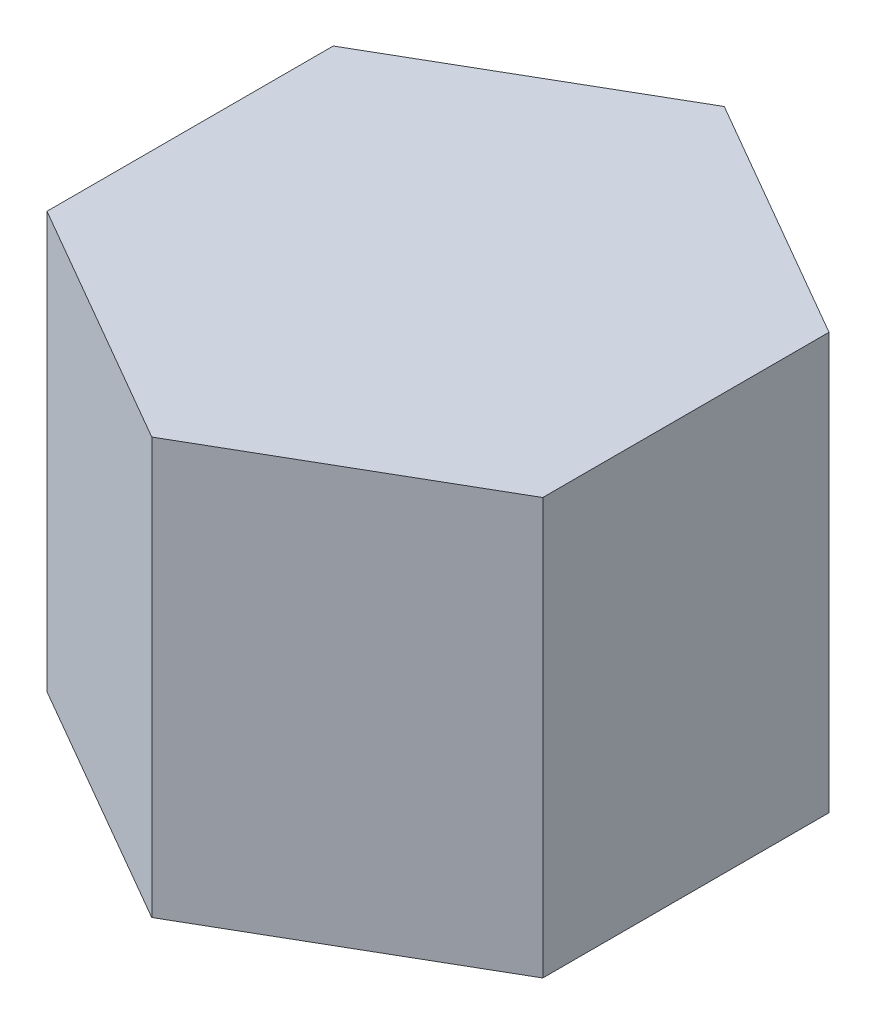
ISO-10303-21;
HEADER;
FILE_DESCRIPTION(('STEP AP214'),'2;1');
FILE_NAME('part.step','',(''),(''),'','','');
FILE_SCHEMA(('AUTOMOTIVE_DESIGN { 1 0 10303 214 1 1 1 1 }'));
ENDSEC;
DATA;
#1=APPLICATION_CONTEXT('core data for automotive mechanical design processes');
#2=APPLICATION_PROTOCOL_DEFINITION('international standard','automotive_design',2000,#1);
#3=PRODUCT_CONTEXT('',#1,'mechanical');
#4=PRODUCT('Part','Part','',(#3));
#5=PRODUCT_RELATED_PRODUCT_CATEGORY('part','',(#4));
#6=PRODUCT_DEFINITION_FORMATION('','',#4);
#7=PRODUCT_DEFINITION_CONTEXT('part definition',#1,'design');
#8=PRODUCT_DEFINITION('design','',#6,#7);
#9=PRODUCT_DEFINITION_SHAPE('','',#8);
#10=(LENGTH_UNIT() NAMED_UNIT(*) SI_UNIT(.MILLI.,.METRE.));
#11=(NAMED_UNIT(*) PLANE_ANGLE_UNIT() SI_UNIT($,.RADIAN.));
#12=(NAMED_UNIT(*) SI_UNIT($,.STERADIAN.) SOLID_ANGLE_UNIT());
#13=UNCERTAINTY_MEASURE_WITH_UNIT(LENGTH_MEASURE(1.E-05),#10,'distance_accuracy_value','');
#14=(GEOMETRIC_REPRESENTATION_CONTEXT(3) GLOBAL_UNCERTAINTY_ASSIGNED_CONTEXT((#13)) GLOBAL_UNIT_ASSIGNED_CONTEXT((#10,
#11,#12)) REPRESENTATION_CONTEXT('',''));
#15=CARTESIAN_POINT('',(0.,0.,0.));
#16=DIRECTION('',(0.,0.,1.));
#17=DIRECTION('',(1.,0.,0.));
#18=AXIS2_PLACEMENT_3D('',#15,#16,#17);
#19=CARTESIAN_POINT('',(202.339551417382,-147.556598747966,289.949920412926));
#20=DIRECTION('',(-0.499999999999943,0.,-0.866025403784471));
#21=DIRECTION('',(-0.866025403784471,0.,0.499999999999943));
#22=AXIS2_PLACEMENT_3D('',#19,#20,#21);
#23=PLANE('',#22);
#24=CARTESIAN_POINT('',(202.642660308706,-147.047793579175,289.774920412926));
#25=DIRECTION('',(-0.866025403784471,0.,0.499999999999943));
#26=VECTOR('',#25,1.);
#27=LINE('',#24,#26);
#28=CARTESIAN_POINT('',(202.642660308706,-147.047793579175,289.774920412926));
#29=VERTEX_POINT('',#28);
#30=CARTESIAN_POINT('',(202.339551417382,-147.047793579175,289.949920412926));
#31=VERTEX_POINT('',#30);
#32=EDGE_CURVE('E170',#29,#31,#27,.T.);
#33=ORIENTED_EDGE('',*,*,#32,.T.);
#34=CARTESIAN_POINT('',(202.339551417382,-147.556598747966,289.949920412926));
#35=DIRECTION('',(0.,1.,0.));
#36=VECTOR('',#35,1.);
#37=LINE('',#34,#36);
#38=CARTESIAN_POINT('',(202.339551417382,-147.556598747966,289.949920412926));
#39=VERTEX_POINT('',#38);
#40=EDGE_CURVE('E35',#39,#31,#37,.T.);
#41=ORIENTED_EDGE('',*,*,#40,.F.);
#42=CARTESIAN_POINT('',(202.642660308706,-147.556598747966,289.774920412926));
#43=DIRECTION('',(-0.866025403784471,0.,0.499999999999943));
#44=VECTOR('',#43,1.);
#45=LINE('',#42,#44);
#46=CARTESIAN_POINT('',(202.642660308706,-147.556598747966,289.774920412926));
#47=VERTEX_POINT('',#46);
#48=EDGE_CURVE('E159',#47,#39,#45,.T.);
#49=ORIENTED_EDGE('',*,*,#48,.F.);
#50=CARTESIAN_POINT('',(202.642660308706,-147.556598747966,289.774920412926));
#51=DIRECTION('',(0.,1.,0.));
#52=VECTOR('',#51,1.);
#53=LINE('',#50,#52);
#54=EDGE_CURVE('E10',#47,#29,#53,.T.);
#55=ORIENTED_EDGE('',*,*,#54,.T.);
#56=EDGE_LOOP('',(#33,#41,#49,#55));
#57=FACE_BOUND('',#56,.T.);
#58=ADVANCED_FACE('F16',(#57),#23,.F.);
#59=CARTESIAN_POINT('',(202.642660308706,-147.556598747966,291.594471220494));
#60=DIRECTION('',(-1.,0.,0.));
#61=DIRECTION('',(0.,-1.,0.));
#62=AXIS2_PLACEMENT_3D('',#59,#60,#61);
#63=PLANE('',#62);
#64=CARTESIAN_POINT('',(202.642660308706,-147.047793579175,289.424920412926));
#65=DIRECTION('',(0.,0.,1.));
#66=VECTOR('',#65,1.);
#67=LINE('',#64,#66);
#68=CARTESIAN_POINT('',(202.642660308706,-147.047793579175,289.424920412926));
#69=VERTEX_POINT('',#68);
#70=EDGE_CURVE('E167',#69,#29,#67,.T.);
#71=ORIENTED_EDGE('',*,*,#70,.T.);
#72=ORIENTED_EDGE('',*,*,#54,.F.);
#73=CARTESIAN_POINT('',(202.642660308706,-147.556598747966,289.424920412926));
#74=DIRECTION('',(0.,0.,1.));
#75=VECTOR('',#74,1.);
#76=LINE('',#73,#75);
#77=CARTESIAN_POINT('',(202.642660308706,-147.556598747966,289.424920412926));
#78=VERTEX_POINT('',#77);
#79=EDGE_CURVE('E156',#78,#47,#76,.T.);
#80=ORIENTED_EDGE('',*,*,#79,.F.);
#81=CARTESIAN_POINT('',(202.642660308706,-147.556598747966,289.424920412926));
#82=DIRECTION('',(0.,1.,0.));
#83=VECTOR('',#82,1.);
#84=LINE('',#81,#83);
#85=EDGE_CURVE('E27',#78,#69,#84,.T.);
#86=ORIENTED_EDGE('',*,*,#85,.T.);
#87=EDGE_LOOP('',(#71,#72,#80,#86));
#88=FACE_BOUND('',#87,.T.);
#89=ADVANCED_FACE('F189',(#88),#63,.F.);
#90=CARTESIAN_POINT('',(202.642660308706,-147.556598747966,289.424920412926));
#91=DIRECTION('',(-0.499999999999978,0.,0.866025403784452));
#92=DIRECTION('',(0.866025403784452,0.,0.499999999999978));
#93=AXIS2_PLACEMENT_3D('',#90,#91,#92);
#94=PLANE('',#93);
#95=CARTESIAN_POINT('',(202.339551417382,-147.047793579175,289.249920412926));
#96=DIRECTION('',(0.866025403784452,0.,0.499999999999978));
#97=VECTOR('',#96,1.);
#98=LINE('',#95,#97);
#99=CARTESIAN_POINT('',(202.339551417382,-147.047793579175,289.249920412926));
#100=VERTEX_POINT('',#99);
#101=EDGE_CURVE('E163',#100,#69,#98,.T.);
#102=ORIENTED_EDGE('',*,*,#101,.T.);
#103=ORIENTED_EDGE('',*,*,#85,.F.);
#104=CARTESIAN_POINT('',(202.339551417382,-147.556598747966,289.249920412926));
#105=DIRECTION('',(0.866025403784452,0.,0.499999999999978));
#106=VECTOR('',#105,1.);
#107=LINE('',#104,#106);
#108=CARTESIAN_POINT('',(202.339551417382,-147.556598747966,289.249920412926));
#109=VERTEX_POINT('',#108);
#110=EDGE_CURVE('E106',#109,#78,#107,.T.);
#111=ORIENTED_EDGE('',*,*,#110,.F.);
#112=CARTESIAN_POINT('',(202.339551417382,-147.556598747966,289.249920412926));
#113=DIRECTION('',(0.,1.,0.));
#114=VECTOR('',#113,1.);
#115=LINE('',#112,#114);
#116=EDGE_CURVE('E94',#109,#100,#115,.T.);
#117=ORIENTED_EDGE('',*,*,#116,.T.);
#118=EDGE_LOOP('',(#102,#103,#111,#117));
#119=FACE_BOUND('',#118,.T.);
#120=ADVANCED_FACE('F198',(#119),#94,.F.);
#121=CARTESIAN_POINT('',(202.339551417382,-147.556598747966,289.249920412926));
#122=DIRECTION('',(0.499999999999978,0.,0.866025403784452));
#123=DIRECTION('',(0.866025403784452,0.,-0.499999999999978));
#124=AXIS2_PLACEMENT_3D('',#121,#122,#123);
#125=PLANE('',#124);
#126=CARTESIAN_POINT('',(202.036442526057,-147.047793579175,289.424920412926));
#127=DIRECTION('',(0.866025403784452,0.,-0.499999999999978));
#128=VECTOR('',#127,1.);
#129=LINE('',#126,#128);
#130=CARTESIAN_POINT('',(202.036442526057,-147.047793579175,289.424920412926));
#131=VERTEX_POINT('',#130);
#132=EDGE_CURVE('E162',#131,#100,#129,.T.);
#133=ORIENTED_EDGE('',*,*,#132,.T.);
#134=ORIENTED_EDGE('',*,*,#116,.F.);
#135=CARTESIAN_POINT('',(202.036442526057,-147.556598747966,289.424920412926));
#136=DIRECTION('',(0.866025403784452,0.,-0.499999999999978));
#137=VECTOR('',#136,1.);
#138=LINE('',#135,#137);
#139=CARTESIAN_POINT('',(202.036442526057,-147.556598747966,289.424920412926));
#140=VERTEX_POINT('',#139);
#141=EDGE_CURVE('E98',#140,#109,#138,.T.);
#142=ORIENTED_EDGE('',*,*,#141,.F.);
#143=CARTESIAN_POINT('',(202.036442526057,-147.556598747966,289.424920412926));
#144=DIRECTION('',(0.,1.,0.));
#145=VECTOR('',#144,1.);
#146=LINE('',#143,#145);
#147=EDGE_CURVE('E79',#140,#131,#146,.T.);
#148=ORIENTED_EDGE('',*,*,#147,.T.);
#149=EDGE_LOOP('',(#133,#134,#142,#148));
#150=FACE_BOUND('',#149,.T.);
#151=ADVANCED_FACE('F100',(#150),#125,.F.);
#152=CARTESIAN_POINT('',(202.036442526057,-147.556598747966,291.594471220494));
#153=DIRECTION('',(1.,0.,0.));
#154=DIRECTION('',(0.,1.,0.));
#155=AXIS2_PLACEMENT_3D('',#152,#153,#154);
#156=PLANE('',#155);
#157=CARTESIAN_POINT('',(202.036442526057,-147.047793579175,289.774920412926));
#158=DIRECTION('',(0.,0.,-1.));
#159=VECTOR('',#158,1.);
#160=LINE('',#157,#159);
#161=CARTESIAN_POINT('',(202.036442526057,-147.047793579175,289.774920412926));
#162=VERTEX_POINT('',#161);
#163=EDGE_CURVE('E88',#162,#131,#160,.T.);
#164=ORIENTED_EDGE('',*,*,#163,.T.);
#165=ORIENTED_EDGE('',*,*,#147,.F.);
#166=CARTESIAN_POINT('',(202.036442526057,-147.556598747966,289.774920412926));
#167=DIRECTION('',(0.,0.,-1.));
#168=VECTOR('',#167,1.);
#169=LINE('',#166,#168);
#170=CARTESIAN_POINT('',(202.036442526057,-147.556598747966,289.774920412926));
#171=VERTEX_POINT('',#170);
#172=EDGE_CURVE('E84',#171,#140,#169,.T.);
#173=ORIENTED_EDGE('',*,*,#172,.F.);
#174=CARTESIAN_POINT('',(202.036442526057,-147.556598747966,289.774920412926));
#175=DIRECTION('',(0.,1.,0.));
#176=VECTOR('',#175,1.);
#177=LINE('',#174,#176);
#178=EDGE_CURVE('E58',#171,#162,#177,.T.);
#179=ORIENTED_EDGE('',*,*,#178,.T.);
#180=EDGE_LOOP('',(#164,#165,#173,#179));
#181=FACE_BOUND('',#180,.T.);
#182=ADVANCED_FACE('F82',(#181),#156,.F.);
#183=CARTESIAN_POINT('',(202.036442526057,-147.556598747966,289.774920412926));
#184=DIRECTION('',(0.499999999999943,0.,-0.866025403784471));
#185=DIRECTION('',(-0.866025403784471,0.,-0.499999999999943));
#186=AXIS2_PLACEMENT_3D('',#183,#184,#185);
#187=PLANE('',#186);
#188=CARTESIAN_POINT('',(202.339551417382,-147.047793579175,289.949920412926));
#189=DIRECTION('',(-0.866025403784471,0.,-0.499999999999943));
#190=VECTOR('',#189,1.);
#191=LINE('',#188,#190);
#192=EDGE_CURVE('E160',#31,#162,#191,.T.);
#193=ORIENTED_EDGE('',*,*,#192,.T.);
#194=ORIENTED_EDGE('',*,*,#178,.F.);
#195=CARTESIAN_POINT('',(202.339551417382,-147.556598747966,289.949920412926));
#196=DIRECTION('',(-0.866025403784471,0.,-0.499999999999943));
#197=VECTOR('',#196,1.);
#198=LINE('',#195,#197);
#199=EDGE_CURVE('E112',#39,#171,#198,.T.);
#200=ORIENTED_EDGE('',*,*,#199,.F.);
#201=ORIENTED_EDGE('',*,*,#40,.T.);
#202=EDGE_LOOP('',(#193,#194,#200,#201));
#203=FACE_BOUND('',#202,.T.);
#204=ADVANCED_FACE('F131',(#203),#187,.F.);
#205=CARTESIAN_POINT('',(206.491105863044,-147.556598747966,291.594471220494));
#206=DIRECTION('',(0.,1.,0.));
#207=DIRECTION('',(-1.,0.,0.));
#208=AXIS2_PLACEMENT_3D('',#205,#206,#207);
#209=PLANE('',#208);
#210=ORIENTED_EDGE('',*,*,#48,.T.);
#211=ORIENTED_EDGE('',*,*,#199,.T.);
#212=ORIENTED_EDGE('',*,*,#172,.T.);
#213=ORIENTED_EDGE('',*,*,#141,.T.);
#214=ORIENTED_EDGE('',*,*,#110,.T.);
#215=ORIENTED_EDGE('',*,*,#79,.T.);
#216=EDGE_LOOP('',(#210,#211,#212,#213,#214,#215));
#217=FACE_BOUND('',#216,.T.);
#218=ADVANCED_FACE('F111',(#217),#209,.F.);
#219=CARTESIAN_POINT('',(206.491105863044,-147.047793579175,291.594471220494));
#220=DIRECTION('',(0.,1.,0.));
#221=DIRECTION('',(-1.,0.,0.));
#222=AXIS2_PLACEMENT_3D('',#219,#220,#221);
#223=PLANE('',#222);
#224=ORIENTED_EDGE('',*,*,#32,.F.);
#225=ORIENTED_EDGE('',*,*,#70,.F.);
#226=ORIENTED_EDGE('',*,*,#101,.F.);
#227=ORIENTED_EDGE('',*,*,#132,.F.);
#228=ORIENTED_EDGE('',*,*,#163,.F.);
#229=ORIENTED_EDGE('',*,*,#192,.F.);
#230=EDGE_LOOP('',(#224,#225,#226,#227,#228,#229));
#231=FACE_BOUND('',#230,.T.);
#232=ADVANCED_FACE('F130',(#231),#223,.T.);
#233=CLOSED_SHELL('',(#58,#89,#120,#151,#182,#204,#218,#232));
#234=MANIFOLD_SOLID_BREP('B1',#233);
#235=ADVANCED_BREP_SHAPE_REPRESENTATION('',(#18,#234),#14);
#236=SHAPE_DEFINITION_REPRESENTATION(#9,#235);
ENDSEC;
END-ISO-10303-21;
